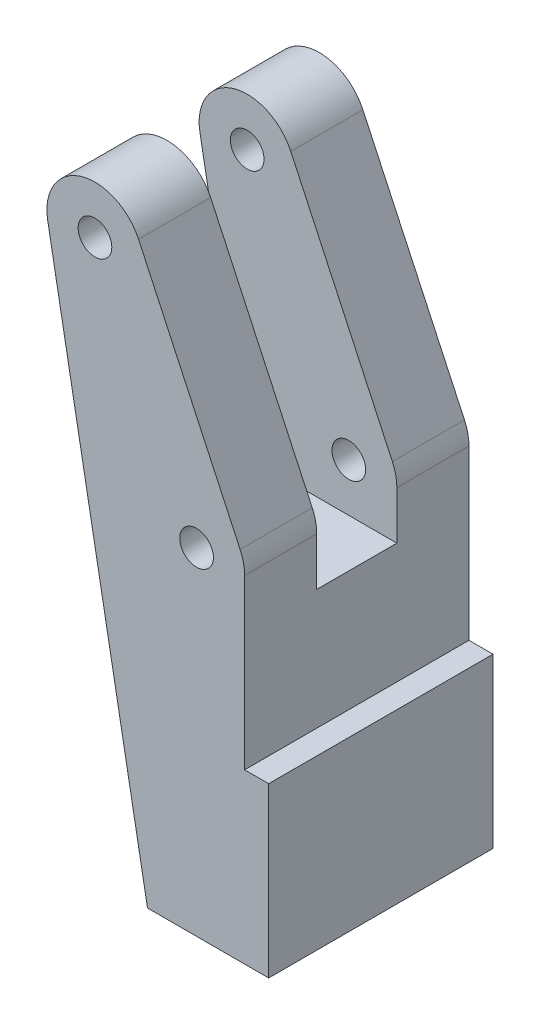
ISO-10303-21;
HEADER;
FILE_DESCRIPTION(('STEP AP214'),'2;1');
FILE_NAME('part.step','',(''),(''),'','','');
FILE_SCHEMA(('AUTOMOTIVE_DESIGN { 1 0 10303 214 1 1 1 1 }'));
ENDSEC;
DATA;
#1=APPLICATION_CONTEXT('core data for automotive mechanical design processes');
#2=APPLICATION_PROTOCOL_DEFINITION('international standard','automotive_design',2000,#1);
#3=PRODUCT_CONTEXT('',#1,'mechanical');
#4=PRODUCT('Part','Part','',(#3));
#5=PRODUCT_RELATED_PRODUCT_CATEGORY('part','',(#4));
#6=PRODUCT_DEFINITION_FORMATION('','',#4);
#7=PRODUCT_DEFINITION_CONTEXT('part definition',#1,'design');
#8=PRODUCT_DEFINITION('design','',#6,#7);
#9=PRODUCT_DEFINITION_SHAPE('','',#8);
#10=(LENGTH_UNIT() NAMED_UNIT(*) SI_UNIT(.MILLI.,.METRE.));
#11=(NAMED_UNIT(*) PLANE_ANGLE_UNIT() SI_UNIT($,.RADIAN.));
#12=(NAMED_UNIT(*) SI_UNIT($,.STERADIAN.) SOLID_ANGLE_UNIT());
#13=UNCERTAINTY_MEASURE_WITH_UNIT(LENGTH_MEASURE(1.E-05),#10,'distance_accuracy_value','');
#14=(GEOMETRIC_REPRESENTATION_CONTEXT(3) GLOBAL_UNCERTAINTY_ASSIGNED_CONTEXT((#13)) GLOBAL_UNIT_ASSIGNED_CONTEXT((#10,
#11,#12)) REPRESENTATION_CONTEXT('',''));
#15=CARTESIAN_POINT('',(0.,0.,0.));
#16=DIRECTION('',(0.,0.,1.));
#17=DIRECTION('',(1.,0.,0.));
#18=AXIS2_PLACEMENT_3D('',#15,#16,#17);
#19=CARTESIAN_POINT('',(5.,0.,7.5));
#20=DIRECTION('',(-1.,0.,0.));
#21=DIRECTION('',(0.,-1.,0.));
#22=AXIS2_PLACEMENT_3D('',#19,#20,#21);
#23=PLANE('',#22);
#24=DIRECTION('',(0.,0.,1.));
#25=VECTOR('',#24,1.);
#26=CARTESIAN_POINT('',(5.,-17.5,23.3333333333333));
#27=LINE('',#26,#25);
#28=CARTESIAN_POINT('',(5.,-17.5,0.));
#29=VERTEX_POINT('',#28);
#30=CARTESIAN_POINT('',(5.,-17.5,23.3333333333333));
#31=VERTEX_POINT('',#30);
#32=EDGE_CURVE('E160',#29,#31,#27,.T.);
#33=ORIENTED_EDGE('',*,*,#32,.F.);
#34=DIRECTION('',(0.,1.,0.));
#35=VECTOR('',#34,1.);
#36=CARTESIAN_POINT('',(5.,0.,0.));
#37=LINE('',#36,#35);
#38=CARTESIAN_POINT('',(5.,0.,0.));
#39=VERTEX_POINT('',#38);
#40=EDGE_CURVE('E166',#29,#39,#37,.T.);
#41=ORIENTED_EDGE('',*,*,#40,.T.);
#42=DIRECTION('',(0.,0.,-1.));
#43=VECTOR('',#42,1.);
#44=CARTESIAN_POINT('',(5.,0.,7.5));
#45=LINE('',#44,#43);
#46=CARTESIAN_POINT('',(5.,0.,7.5));
#47=VERTEX_POINT('',#46);
#48=EDGE_CURVE('E11',#47,#39,#45,.T.);
#49=ORIENTED_EDGE('',*,*,#48,.F.);
#50=DIRECTION('',(0.,1.,0.));
#51=VECTOR('',#50,1.);
#52=CARTESIAN_POINT('',(5.,0.,7.5));
#53=LINE('',#52,#51);
#54=CARTESIAN_POINT('',(5.,-5.,7.5));
#55=VERTEX_POINT('',#54);
#56=EDGE_CURVE('E273',#55,#47,#53,.T.);
#57=ORIENTED_EDGE('',*,*,#56,.F.);
#58=DIRECTION('',(0.,0.,-1.));
#59=VECTOR('',#58,1.);
#60=CARTESIAN_POINT('',(5.,-5.,15.8333333333333));
#61=LINE('',#60,#59);
#62=CARTESIAN_POINT('',(5.,-5.,15.8333333333333));
#63=VERTEX_POINT('',#62);
#64=EDGE_CURVE('E252',#63,#55,#61,.T.);
#65=ORIENTED_EDGE('',*,*,#64,.F.);
#66=DIRECTION('',(0.,1.,0.));
#67=VECTOR('',#66,1.);
#68=CARTESIAN_POINT('',(5.,0.,15.8333333333333));
#69=LINE('',#68,#67);
#70=CARTESIAN_POINT('',(5.,0.,15.8333333333333));
#71=VERTEX_POINT('',#70);
#72=EDGE_CURVE('E195',#63,#71,#69,.T.);
#73=ORIENTED_EDGE('',*,*,#72,.T.);
#74=DIRECTION('',(0.,0.,-1.));
#75=VECTOR('',#74,1.);
#76=CARTESIAN_POINT('',(5.,0.,23.3333333333333));
#77=LINE('',#76,#75);
#78=CARTESIAN_POINT('',(5.,0.,23.3333333333333));
#79=VERTEX_POINT('',#78);
#80=EDGE_CURVE('E211',#79,#71,#77,.T.);
#81=ORIENTED_EDGE('',*,*,#80,.F.);
#82=DIRECTION('',(0.,1.,0.));
#83=VECTOR('',#82,1.);
#84=CARTESIAN_POINT('',(5.,0.,23.3333333333333));
#85=LINE('',#84,#83);
#86=EDGE_CURVE('E208',#31,#79,#85,.T.);
#87=ORIENTED_EDGE('',*,*,#86,.F.);
#88=EDGE_LOOP('',(#33,#41,#49,#57,#65,#73,#81,#87));
#89=FACE_BOUND('',#88,.T.);
#90=ADVANCED_FACE('F39',(#89),#23,.F.);
#91=CARTESIAN_POINT('',(-10.5654565435173,22.6576946759163,7.5));
#92=DIRECTION('',(0.,0.,1.));
#93=DIRECTION('',(1.,0.,0.));
#94=AXIS2_PLACEMENT_3D('',#91,#92,#93);
#95=PLANE('',#94);
#96=DIRECTION('',(-1.,0.,0.));
#97=VECTOR('',#96,1.);
#98=CARTESIAN_POINT('',(5.,-5.,7.5));
#99=LINE('',#98,#97);
#100=CARTESIAN_POINT('',(-10.5898274549361,-5.,7.5));
#101=VERTEX_POINT('',#100);
#102=EDGE_CURVE('E63',#55,#101,#99,.T.);
#103=ORIENTED_EDGE('',*,*,#102,.F.);
#104=ORIENTED_EDGE('',*,*,#56,.T.);
#105=CARTESIAN_POINT('',(0.,0.,7.5));
#106=DIRECTION('',(0.,0.,1.));
#107=DIRECTION('',(1.,0.,0.));
#108=AXIS2_PLACEMENT_3D('',#105,#106,#107);
#109=CIRCLE('',#108,5.);
#110=CARTESIAN_POINT('',(4.53153893518326,2.11309130870347,7.5));
#111=VERTEX_POINT('',#110);
#112=EDGE_CURVE('E276',#47,#111,#109,.T.);
#113=ORIENTED_EDGE('',*,*,#112,.T.);
#114=DIRECTION('',(-0.422618261740694,0.906307787036653,0.));
#115=VECTOR('',#114,1.);
#116=CARTESIAN_POINT('',(-6.03391760833409,24.7707859846198,7.5));
#117=LINE('',#116,#115);
#118=CARTESIAN_POINT('',(-6.03391760833409,24.7707859846198,7.5));
#119=VERTEX_POINT('',#118);
#120=EDGE_CURVE('E280',#111,#119,#117,.T.);
#121=ORIENTED_EDGE('',*,*,#120,.T.);
#122=CARTESIAN_POINT('',(-10.5654565435173,22.6576946759163,7.5));
#123=DIRECTION('',(0.,0.,1.));
#124=DIRECTION('',(1.,0.,0.));
#125=AXIS2_PLACEMENT_3D('',#122,#123,#124);
#126=CIRCLE('',#125,5.);
#127=CARTESIAN_POINT('',(-15.48386758941,21.7581210082041,7.5));
#128=VERTEX_POINT('',#127);
#129=EDGE_CURVE('E283',#119,#128,#126,.T.);
#130=ORIENTED_EDGE('',*,*,#129,.T.);
#131=DIRECTION('',(0.17991473354245,-0.983682209178528,0.));
#132=VECTOR('',#131,1.);
#133=CARTESIAN_POINT('',(-5.10285009994166,-35.,7.5));
#134=LINE('',#133,#132);
#135=EDGE_CURVE('E286',#128,#101,#134,.T.);
#136=ORIENTED_EDGE('',*,*,#135,.T.);
#137=EDGE_LOOP('',(#103,#104,#113,#121,#130,#136));
#138=FACE_BOUND('',#137,.T.);
#139=CARTESIAN_POINT('',(-10.5654565435173,22.6576946759163,7.5));
#140=DIRECTION('',(0.,0.,1.));
#141=DIRECTION('',(1.,0.,0.));
#142=AXIS2_PLACEMENT_3D('',#139,#140,#141);
#143=CIRCLE('',#142,1.75);
#144=CARTESIAN_POINT('',(-8.81545654351735,22.6576946759163,7.5));
#145=VERTEX_POINT('',#144);
#146=EDGE_CURVE('E265',#145,#145,#143,.T.);
#147=ORIENTED_EDGE('',*,*,#146,.F.);
#148=EDGE_LOOP('',(#147));
#149=FACE_BOUND('',#148,.T.);
#150=CARTESIAN_POINT('',(0.,0.,7.5));
#151=DIRECTION('',(0.,0.,1.));
#152=DIRECTION('',(1.,0.,0.));
#153=AXIS2_PLACEMENT_3D('',#150,#151,#152);
#154=CIRCLE('',#153,1.75);
#155=CARTESIAN_POINT('',(1.75,0.,7.5));
#156=VERTEX_POINT('',#155);
#157=EDGE_CURVE('E257',#156,#156,#154,.T.);
#158=ORIENTED_EDGE('',*,*,#157,.F.);
#159=EDGE_LOOP('',(#158));
#160=FACE_BOUND('',#159,.T.);
#161=ADVANCED_FACE('F334',(#138,#149,#160),#95,.T.);
#162=CARTESIAN_POINT('',(-10.5654565435173,22.6576946759163,0.));
#163=DIRECTION('',(0.,0.,1.));
#164=DIRECTION('',(1.,0.,0.));
#165=AXIS2_PLACEMENT_3D('',#162,#163,#164);
#166=PLANE('',#165);
#167=DIRECTION('',(1.,0.,0.));
#168=VECTOR('',#167,1.);
#169=CARTESIAN_POINT('',(5.,-35.,0.));
#170=LINE('',#169,#168);
#171=CARTESIAN_POINT('',(-5.10285009994166,-35.,0.));
#172=VERTEX_POINT('',#171);
#173=CARTESIAN_POINT('',(7.50000000000001,-35.,0.));
#174=VERTEX_POINT('',#173);
#175=EDGE_CURVE('E269',#172,#174,#170,.T.);
#176=ORIENTED_EDGE('',*,*,#175,.F.);
#177=DIRECTION('',(0.17991473354245,-0.983682209178528,0.));
#178=VECTOR('',#177,1.);
#179=CARTESIAN_POINT('',(-5.10285009994166,-35.,0.));
#180=LINE('',#179,#178);
#181=CARTESIAN_POINT('',(-15.48386758941,21.7581210082041,0.));
#182=VERTEX_POINT('',#181);
#183=EDGE_CURVE('E277',#182,#172,#180,.T.);
#184=ORIENTED_EDGE('',*,*,#183,.F.);
#185=CARTESIAN_POINT('',(-10.5654565435173,22.6576946759163,0.));
#186=DIRECTION('',(0.,0.,1.));
#187=DIRECTION('',(1.,0.,0.));
#188=AXIS2_PLACEMENT_3D('',#185,#186,#187);
#189=CIRCLE('',#188,5.);
#190=CARTESIAN_POINT('',(-6.03391760833409,24.7707859846198,0.));
#191=VERTEX_POINT('',#190);
#192=EDGE_CURVE('E300',#191,#182,#189,.T.);
#193=ORIENTED_EDGE('',*,*,#192,.F.);
#194=DIRECTION('',(-0.422618261740694,0.906307787036653,0.));
#195=VECTOR('',#194,1.);
#196=CARTESIAN_POINT('',(-6.03391760833409,24.7707859846198,0.));
#197=LINE('',#196,#195);
#198=CARTESIAN_POINT('',(4.53153893518326,2.11309130870347,0.));
#199=VERTEX_POINT('',#198);
#200=EDGE_CURVE('E297',#199,#191,#197,.T.);
#201=ORIENTED_EDGE('',*,*,#200,.F.);
#202=CARTESIAN_POINT('',(0.,0.,0.));
#203=DIRECTION('',(0.,0.,1.));
#204=DIRECTION('',(1.,0.,0.));
#205=AXIS2_PLACEMENT_3D('',#202,#203,#204);
#206=CIRCLE('',#205,5.);
#207=EDGE_CURVE('E294',#39,#199,#206,.T.);
#208=ORIENTED_EDGE('',*,*,#207,.F.);
#209=ORIENTED_EDGE('',*,*,#40,.F.);
#210=DIRECTION('',(-1.,0.,0.));
#211=VECTOR('',#210,1.);
#212=CARTESIAN_POINT('',(7.5,-17.5,0.));
#213=LINE('',#212,#211);
#214=CARTESIAN_POINT('',(7.5,-17.5,0.));
#215=VERTEX_POINT('',#214);
#216=EDGE_CURVE('E144',#215,#29,#213,.T.);
#217=ORIENTED_EDGE('',*,*,#216,.F.);
#218=DIRECTION('',(0.,1.,0.));
#219=VECTOR('',#218,1.);
#220=CARTESIAN_POINT('',(7.5,-17.5,0.));
#221=LINE('',#220,#219);
#222=EDGE_CURVE('E150',#174,#215,#221,.T.);
#223=ORIENTED_EDGE('',*,*,#222,.F.);
#224=EDGE_LOOP('',(#176,#184,#193,#201,#208,#209,#217,#223));
#225=FACE_BOUND('',#224,.T.);
#226=CARTESIAN_POINT('',(-10.5654565435173,22.6576946759163,0.));
#227=DIRECTION('',(0.,0.,1.));
#228=DIRECTION('',(1.,0.,0.));
#229=AXIS2_PLACEMENT_3D('',#226,#227,#228);
#230=CIRCLE('',#229,1.75);
#231=CARTESIAN_POINT('',(-8.81545654351735,22.6576946759163,0.));
#232=VERTEX_POINT('',#231);
#233=EDGE_CURVE('E261',#232,#232,#230,.T.);
#234=ORIENTED_EDGE('',*,*,#233,.T.);
#235=EDGE_LOOP('',(#234));
#236=FACE_BOUND('',#235,.T.);
#237=CARTESIAN_POINT('',(0.,0.,0.));
#238=DIRECTION('',(0.,0.,1.));
#239=DIRECTION('',(1.,0.,0.));
#240=AXIS2_PLACEMENT_3D('',#237,#238,#239);
#241=CIRCLE('',#240,1.75);
#242=CARTESIAN_POINT('',(1.75,0.,0.));
#243=VERTEX_POINT('',#242);
#244=EDGE_CURVE('E256',#243,#243,#241,.T.);
#245=ORIENTED_EDGE('',*,*,#244,.T.);
#246=EDGE_LOOP('',(#245));
#247=FACE_BOUND('',#246,.T.);
#248=ADVANCED_FACE('F163',(#225,#236,#247),#166,.F.);
#249=CARTESIAN_POINT('',(5.,-35.,7.5));
#250=DIRECTION('',(0.,1.,0.));
#251=DIRECTION('',(0.,0.,1.));
#252=AXIS2_PLACEMENT_3D('',#249,#250,#251);
#253=PLANE('',#252);
#254=ORIENTED_EDGE('',*,*,#175,.T.);
#255=DIRECTION('',(0.,0.,-1.));
#256=VECTOR('',#255,1.);
#257=CARTESIAN_POINT('',(7.50000000000001,-35.,0.));
#258=LINE('',#257,#256);
#259=CARTESIAN_POINT('',(7.50000000000001,-35.,23.3333333333333));
#260=VERTEX_POINT('',#259);
#261=EDGE_CURVE('E156',#260,#174,#258,.T.);
#262=ORIENTED_EDGE('',*,*,#261,.F.);
#263=DIRECTION('',(1.,0.,0.));
#264=VECTOR('',#263,1.);
#265=CARTESIAN_POINT('',(5.,-35.,23.3333333333333));
#266=LINE('',#265,#264);
#267=CARTESIAN_POINT('',(-5.10285009994166,-35.,23.3333333333333));
#268=VERTEX_POINT('',#267);
#269=EDGE_CURVE('E205',#268,#260,#266,.T.);
#270=ORIENTED_EDGE('',*,*,#269,.F.);
#271=DIRECTION('',(0.,0.,-1.));
#272=VECTOR('',#271,1.);
#273=CARTESIAN_POINT('',(-5.10285009994166,-35.,7.5));
#274=LINE('',#273,#272);
#275=EDGE_CURVE('E289',#268,#172,#274,.T.);
#276=ORIENTED_EDGE('',*,*,#275,.T.);
#277=EDGE_LOOP('',(#254,#262,#270,#276));
#278=FACE_BOUND('',#277,.T.);
#279=ADVANCED_FACE('F41',(#278),#253,.F.);
#280=CARTESIAN_POINT('',(0.,0.,7.5));
#281=DIRECTION('',(0.,0.,-1.));
#282=DIRECTION('',(-1.,0.,0.));
#283=AXIS2_PLACEMENT_3D('',#280,#281,#282);
#284=CYLINDRICAL_SURFACE('',#283,5.);
#285=ORIENTED_EDGE('',*,*,#207,.T.);
#286=DIRECTION('',(0.,0.,-1.));
#287=VECTOR('',#286,1.);
#288=CARTESIAN_POINT('',(4.53153893518326,2.11309130870347,7.5));
#289=LINE('',#288,#287);
#290=EDGE_CURVE('E48',#111,#199,#289,.T.);
#291=ORIENTED_EDGE('',*,*,#290,.F.);
#292=ORIENTED_EDGE('',*,*,#112,.F.);
#293=ORIENTED_EDGE('',*,*,#48,.T.);
#294=EDGE_LOOP('',(#285,#291,#292,#293));
#295=FACE_BOUND('',#294,.T.);
#296=ADVANCED_FACE('F371',(#295),#284,.T.);
#297=CARTESIAN_POINT('',(-6.03391760833409,24.7707859846198,7.5));
#298=DIRECTION('',(-0.906307787036652,-0.422618261740694,0.));
#299=DIRECTION('',(0.422618261740694,-0.906307787036652,0.));
#300=AXIS2_PLACEMENT_3D('',#297,#298,#299);
#301=PLANE('',#300);
#302=ORIENTED_EDGE('',*,*,#200,.T.);
#303=DIRECTION('',(0.,0.,-1.));
#304=VECTOR('',#303,1.);
#305=CARTESIAN_POINT('',(-6.03391760833409,24.7707859846198,7.5));
#306=LINE('',#305,#304);
#307=EDGE_CURVE('E312',#119,#191,#306,.T.);
#308=ORIENTED_EDGE('',*,*,#307,.F.);
#309=ORIENTED_EDGE('',*,*,#120,.F.);
#310=ORIENTED_EDGE('',*,*,#290,.T.);
#311=EDGE_LOOP('',(#302,#308,#309,#310));
#312=FACE_BOUND('',#311,.T.);
#313=ADVANCED_FACE('F321',(#312),#301,.F.);
#314=CARTESIAN_POINT('',(-10.5654565435173,22.6576946759163,7.5));
#315=DIRECTION('',(0.,0.,-1.));
#316=DIRECTION('',(-1.,0.,0.));
#317=AXIS2_PLACEMENT_3D('',#314,#315,#316);
#318=CYLINDRICAL_SURFACE('',#317,5.);
#319=ORIENTED_EDGE('',*,*,#192,.T.);
#320=DIRECTION('',(0.,0.,-1.));
#321=VECTOR('',#320,1.);
#322=CARTESIAN_POINT('',(-15.48386758941,21.7581210082041,7.5));
#323=LINE('',#322,#321);
#324=EDGE_CURVE('E308',#128,#182,#323,.T.);
#325=ORIENTED_EDGE('',*,*,#324,.F.);
#326=ORIENTED_EDGE('',*,*,#129,.F.);
#327=ORIENTED_EDGE('',*,*,#307,.T.);
#328=EDGE_LOOP('',(#319,#325,#326,#327));
#329=FACE_BOUND('',#328,.T.);
#330=ADVANCED_FACE('F329',(#329),#318,.T.);
#331=CARTESIAN_POINT('',(-5.10285009994166,-35.,7.5));
#332=DIRECTION('',(0.983682209178528,0.17991473354245,0.));
#333=DIRECTION('',(-0.17991473354245,0.983682209178528,0.));
#334=AXIS2_PLACEMENT_3D('',#331,#332,#333);
#335=PLANE('',#334);
#336=ORIENTED_EDGE('',*,*,#183,.T.);
#337=ORIENTED_EDGE('',*,*,#275,.F.);
#338=DIRECTION('',(0.17991473354245,-0.983682209178528,0.));
#339=VECTOR('',#338,1.);
#340=CARTESIAN_POINT('',(-5.10285009994166,-35.,23.3333333333333));
#341=LINE('',#340,#339);
#342=CARTESIAN_POINT('',(-15.48386758941,21.7581210082041,23.3333333333333));
#343=VERTEX_POINT('',#342);
#344=EDGE_CURVE('E201',#343,#268,#341,.T.);
#345=ORIENTED_EDGE('',*,*,#344,.F.);
#346=DIRECTION('',(0.,0.,-1.));
#347=VECTOR('',#346,1.);
#348=CARTESIAN_POINT('',(-15.48386758941,21.7581210082041,23.3333333333333));
#349=LINE('',#348,#347);
#350=CARTESIAN_POINT('',(-15.48386758941,21.7581210082041,15.8333333333333));
#351=VERTEX_POINT('',#350);
#352=EDGE_CURVE('E230',#343,#351,#349,.T.);
#353=ORIENTED_EDGE('',*,*,#352,.T.);
#354=DIRECTION('',(0.17991473354245,-0.983682209178528,0.));
#355=VECTOR('',#354,1.);
#356=CARTESIAN_POINT('',(-5.10285009994166,-35.,15.8333333333333));
#357=LINE('',#356,#355);
#358=CARTESIAN_POINT('',(-10.5898274549361,-5.,15.8333333333333));
#359=VERTEX_POINT('',#358);
#360=EDGE_CURVE('E221',#351,#359,#357,.T.);
#361=ORIENTED_EDGE('',*,*,#360,.T.);
#362=DIRECTION('',(0.,0.,-1.));
#363=VECTOR('',#362,1.);
#364=CARTESIAN_POINT('',(-10.5898274549361,-5.,15.8333333333333));
#365=LINE('',#364,#363);
#366=EDGE_CURVE('E246',#359,#101,#365,.T.);
#367=ORIENTED_EDGE('',*,*,#366,.T.);
#368=ORIENTED_EDGE('',*,*,#135,.F.);
#369=ORIENTED_EDGE('',*,*,#324,.T.);
#370=EDGE_LOOP('',(#336,#337,#345,#353,#361,#367,#368,#369));
#371=FACE_BOUND('',#370,.T.);
#372=ADVANCED_FACE('F333',(#371),#335,.F.);
#373=CARTESIAN_POINT('',(-10.5654565435173,22.6576946759163,7.5));
#374=DIRECTION('',(0.,0.,-1.));
#375=DIRECTION('',(-1.,0.,0.));
#376=AXIS2_PLACEMENT_3D('',#373,#374,#375);
#377=CYLINDRICAL_SURFACE('',#376,1.75);
#378=ORIENTED_EDGE('',*,*,#146,.T.);
#379=EDGE_LOOP('',(#378));
#380=FACE_BOUND('',#379,.T.);
#381=ORIENTED_EDGE('',*,*,#233,.F.);
#382=EDGE_LOOP('',(#381));
#383=FACE_BOUND('',#382,.T.);
#384=ADVANCED_FACE('F392',(#380,#383),#377,.F.);
#385=CARTESIAN_POINT('',(0.,0.,7.5));
#386=DIRECTION('',(0.,0.,-1.));
#387=DIRECTION('',(-1.,0.,0.));
#388=AXIS2_PLACEMENT_3D('',#385,#386,#387);
#389=CYLINDRICAL_SURFACE('',#388,1.75);
#390=ORIENTED_EDGE('',*,*,#157,.T.);
#391=EDGE_LOOP('',(#390));
#392=FACE_BOUND('',#391,.T.);
#393=ORIENTED_EDGE('',*,*,#244,.F.);
#394=EDGE_LOOP('',(#393));
#395=FACE_BOUND('',#394,.T.);
#396=ADVANCED_FACE('F396',(#392,#395),#389,.F.);
#397=CARTESIAN_POINT('',(5.,-5.,15.8333333333333));
#398=DIRECTION('',(0.,-1.,0.));
#399=DIRECTION('',(1.,0.,0.));
#400=AXIS2_PLACEMENT_3D('',#397,#398,#399);
#401=PLANE('',#400);
#402=ORIENTED_EDGE('',*,*,#102,.T.);
#403=ORIENTED_EDGE('',*,*,#366,.F.);
#404=DIRECTION('',(-1.,0.,0.));
#405=VECTOR('',#404,1.);
#406=CARTESIAN_POINT('',(5.,-5.,15.8333333333333));
#407=LINE('',#406,#405);
#408=EDGE_CURVE('E242',#63,#359,#407,.T.);
#409=ORIENTED_EDGE('',*,*,#408,.F.);
#410=ORIENTED_EDGE('',*,*,#64,.T.);
#411=EDGE_LOOP('',(#402,#403,#409,#410));
#412=FACE_BOUND('',#411,.T.);
#413=ADVANCED_FACE('F337',(#412),#401,.F.);
#414=CARTESIAN_POINT('',(0.,0.,15.8333333333333));
#415=DIRECTION('',(0.,0.,1.));
#416=DIRECTION('',(1.,0.,0.));
#417=AXIS2_PLACEMENT_3D('',#414,#415,#416);
#418=PLANE('',#417);
#419=CARTESIAN_POINT('',(0.,0.,15.8333333333333));
#420=DIRECTION('',(0.,0.,1.));
#421=DIRECTION('',(1.,0.,0.));
#422=AXIS2_PLACEMENT_3D('',#419,#420,#421);
#423=CIRCLE('',#422,1.74999999999993);
#424=CARTESIAN_POINT('',(1.74999999999985,0.,15.8333333333333));
#425=VERTEX_POINT('',#424);
#426=EDGE_CURVE('E180',#425,#425,#423,.T.);
#427=ORIENTED_EDGE('',*,*,#426,.T.);
#428=EDGE_LOOP('',(#427));
#429=FACE_BOUND('',#428,.T.);
#430=CARTESIAN_POINT('',(-10.5654565435173,22.6576946759163,15.8333333333333));
#431=DIRECTION('',(0.,0.,1.));
#432=DIRECTION('',(1.,0.,0.));
#433=AXIS2_PLACEMENT_3D('',#430,#431,#432);
#434=CIRCLE('',#433,1.75);
#435=CARTESIAN_POINT('',(-8.81545654351735,22.6576946759163,15.8333333333333));
#436=VERTEX_POINT('',#435);
#437=EDGE_CURVE('E168',#436,#436,#434,.T.);
#438=ORIENTED_EDGE('',*,*,#437,.T.);
#439=EDGE_LOOP('',(#438));
#440=FACE_BOUND('',#439,.T.);
#441=ORIENTED_EDGE('',*,*,#72,.F.);
#442=ORIENTED_EDGE('',*,*,#408,.T.);
#443=ORIENTED_EDGE('',*,*,#360,.F.);
#444=CARTESIAN_POINT('',(-10.5654565435173,22.6576946759163,15.8333333333333));
#445=DIRECTION('',(0.,0.,1.));
#446=DIRECTION('',(-1.,0.,0.));
#447=AXIS2_PLACEMENT_3D('',#444,#445,#446);
#448=CIRCLE('',#447,5.);
#449=CARTESIAN_POINT('',(-6.03391760833409,24.7707859846198,15.8333333333333));
#450=VERTEX_POINT('',#449);
#451=EDGE_CURVE('E218',#450,#351,#448,.T.);
#452=ORIENTED_EDGE('',*,*,#451,.F.);
#453=DIRECTION('',(-0.422618261740694,0.906307787036653,0.));
#454=VECTOR('',#453,1.);
#455=CARTESIAN_POINT('',(-6.03391760833409,24.7707859846198,15.8333333333333));
#456=LINE('',#455,#454);
#457=CARTESIAN_POINT('',(4.53153893518326,2.11309130870347,15.8333333333333));
#458=VERTEX_POINT('',#457);
#459=EDGE_CURVE('E215',#458,#450,#456,.T.);
#460=ORIENTED_EDGE('',*,*,#459,.F.);
#461=CARTESIAN_POINT('',(0.,0.,15.8333333333333));
#462=DIRECTION('',(0.,0.,1.));
#463=DIRECTION('',(1.,0.,0.));
#464=AXIS2_PLACEMENT_3D('',#461,#462,#463);
#465=CIRCLE('',#464,5.00000000000008);
#466=EDGE_CURVE('E186',#71,#458,#465,.T.);
#467=ORIENTED_EDGE('',*,*,#466,.F.);
#468=EDGE_LOOP('',(#441,#442,#443,#452,#460,#467));
#469=FACE_BOUND('',#468,.T.);
#470=ADVANCED_FACE('F345',(#429,#440,#469),#418,.F.);
#471=CARTESIAN_POINT('',(0.,0.,23.3333333333333));
#472=DIRECTION('',(0.,0.,1.));
#473=DIRECTION('',(1.,0.,0.));
#474=AXIS2_PLACEMENT_3D('',#471,#472,#473);
#475=PLANE('',#474);
#476=CARTESIAN_POINT('',(0.,0.,23.3333333333333));
#477=DIRECTION('',(0.,0.,1.));
#478=DIRECTION('',(1.,0.,0.));
#479=AXIS2_PLACEMENT_3D('',#476,#477,#478);
#480=CIRCLE('',#479,1.74999999999993);
#481=CARTESIAN_POINT('',(1.74999999999985,0.,23.3333333333333));
#482=VERTEX_POINT('',#481);
#483=EDGE_CURVE('E182',#482,#482,#480,.T.);
#484=ORIENTED_EDGE('',*,*,#483,.F.);
#485=EDGE_LOOP('',(#484));
#486=FACE_BOUND('',#485,.T.);
#487=CARTESIAN_POINT('',(0.,0.,23.3333333333333));
#488=DIRECTION('',(0.,0.,1.));
#489=DIRECTION('',(1.,0.,0.));
#490=AXIS2_PLACEMENT_3D('',#487,#488,#489);
#491=CIRCLE('',#490,5.00000000000008);
#492=CARTESIAN_POINT('',(4.53153893518326,2.11309130870347,23.3333333333333));
#493=VERTEX_POINT('',#492);
#494=EDGE_CURVE('E190',#79,#493,#491,.T.);
#495=ORIENTED_EDGE('',*,*,#494,.T.);
#496=DIRECTION('',(-0.422618261740694,0.906307787036653,0.));
#497=VECTOR('',#496,1.);
#498=CARTESIAN_POINT('',(-6.03391760833409,24.7707859846198,23.3333333333333));
#499=LINE('',#498,#497);
#500=CARTESIAN_POINT('',(-6.03391760833409,24.7707859846198,23.3333333333333));
#501=VERTEX_POINT('',#500);
#502=EDGE_CURVE('E194',#493,#501,#499,.T.);
#503=ORIENTED_EDGE('',*,*,#502,.T.);
#504=CARTESIAN_POINT('',(-10.5654565435173,22.6576946759163,23.3333333333333));
#505=DIRECTION('',(0.,0.,1.));
#506=DIRECTION('',(-1.,0.,0.));
#507=AXIS2_PLACEMENT_3D('',#504,#505,#506);
#508=CIRCLE('',#507,5.);
#509=EDGE_CURVE('E198',#501,#343,#508,.T.);
#510=ORIENTED_EDGE('',*,*,#509,.T.);
#511=ORIENTED_EDGE('',*,*,#344,.T.);
#512=ORIENTED_EDGE('',*,*,#269,.T.);
#513=DIRECTION('',(0.,-1.,0.));
#514=VECTOR('',#513,1.);
#515=CARTESIAN_POINT('',(7.50000000000001,-35.,23.3333333333333));
#516=LINE('',#515,#514);
#517=CARTESIAN_POINT('',(7.5,-17.5,23.3333333333333));
#518=VERTEX_POINT('',#517);
#519=EDGE_CURVE('E149',#518,#260,#516,.T.);
#520=ORIENTED_EDGE('',*,*,#519,.F.);
#521=DIRECTION('',(-1.,0.,0.));
#522=VECTOR('',#521,1.);
#523=CARTESIAN_POINT('',(7.5,-17.5,23.3333333333333));
#524=LINE('',#523,#522);
#525=EDGE_CURVE('E55',#518,#31,#524,.T.);
#526=ORIENTED_EDGE('',*,*,#525,.T.);
#527=ORIENTED_EDGE('',*,*,#86,.T.);
#528=EDGE_LOOP('',(#495,#503,#510,#511,#512,#520,#526,#527));
#529=FACE_BOUND('',#528,.T.);
#530=CARTESIAN_POINT('',(-10.5654565435173,22.6576946759163,23.3333333333333));
#531=DIRECTION('',(0.,0.,1.));
#532=DIRECTION('',(1.,0.,0.));
#533=AXIS2_PLACEMENT_3D('',#530,#531,#532);
#534=CIRCLE('',#533,1.75);
#535=CARTESIAN_POINT('',(-8.81545654351735,22.6576946759163,23.3333333333333));
#536=VERTEX_POINT('',#535);
#537=EDGE_CURVE('E173',#536,#536,#534,.T.);
#538=ORIENTED_EDGE('',*,*,#537,.F.);
#539=EDGE_LOOP('',(#538));
#540=FACE_BOUND('',#539,.T.);
#541=ADVANCED_FACE('F353',(#486,#529,#540),#475,.T.);
#542=CARTESIAN_POINT('',(0.,0.,23.3333333333333));
#543=DIRECTION('',(0.,0.,-1.));
#544=DIRECTION('',(-1.,0.,0.));
#545=AXIS2_PLACEMENT_3D('',#542,#543,#544);
#546=CYLINDRICAL_SURFACE('',#545,5.00000000000008);
#547=ORIENTED_EDGE('',*,*,#466,.T.);
#548=DIRECTION('',(0.,0.,-1.));
#549=VECTOR('',#548,1.);
#550=CARTESIAN_POINT('',(4.53153893518326,2.11309130870347,23.3333333333333));
#551=LINE('',#550,#549);
#552=EDGE_CURVE('E238',#493,#458,#551,.T.);
#553=ORIENTED_EDGE('',*,*,#552,.F.);
#554=ORIENTED_EDGE('',*,*,#494,.F.);
#555=ORIENTED_EDGE('',*,*,#80,.T.);
#556=EDGE_LOOP('',(#547,#553,#554,#555));
#557=FACE_BOUND('',#556,.T.);
#558=ADVANCED_FACE('F350',(#557),#546,.T.);
#559=CARTESIAN_POINT('',(-6.03391760833409,24.7707859846198,23.3333333333333));
#560=DIRECTION('',(-0.906307787036652,-0.422618261740694,0.));
#561=DIRECTION('',(0.422618261740694,-0.906307787036652,0.));
#562=AXIS2_PLACEMENT_3D('',#559,#560,#561);
#563=PLANE('',#562);
#564=ORIENTED_EDGE('',*,*,#459,.T.);
#565=DIRECTION('',(0.,0.,-1.));
#566=VECTOR('',#565,1.);
#567=CARTESIAN_POINT('',(-6.03391760833409,24.7707859846198,23.3333333333333));
#568=LINE('',#567,#566);
#569=EDGE_CURVE('E234',#501,#450,#568,.T.);
#570=ORIENTED_EDGE('',*,*,#569,.F.);
#571=ORIENTED_EDGE('',*,*,#502,.F.);
#572=ORIENTED_EDGE('',*,*,#552,.T.);
#573=EDGE_LOOP('',(#564,#570,#571,#572));
#574=FACE_BOUND('',#573,.T.);
#575=ADVANCED_FACE('F359',(#574),#563,.F.);
#576=CARTESIAN_POINT('',(-10.5654565435173,22.6576946759163,23.3333333333333));
#577=DIRECTION('',(0.,0.,-1.));
#578=DIRECTION('',(-1.,0.,0.));
#579=AXIS2_PLACEMENT_3D('',#576,#577,#578);
#580=CYLINDRICAL_SURFACE('',#579,5.);
#581=ORIENTED_EDGE('',*,*,#451,.T.);
#582=ORIENTED_EDGE('',*,*,#352,.F.);
#583=ORIENTED_EDGE('',*,*,#509,.F.);
#584=ORIENTED_EDGE('',*,*,#569,.T.);
#585=EDGE_LOOP('',(#581,#582,#583,#584));
#586=FACE_BOUND('',#585,.T.);
#587=ADVANCED_FACE('F361',(#586),#580,.T.);
#588=CARTESIAN_POINT('',(0.,0.,23.3333333333333));
#589=DIRECTION('',(0.,0.,-1.));
#590=DIRECTION('',(-1.,0.,0.));
#591=AXIS2_PLACEMENT_3D('',#588,#589,#590);
#592=CYLINDRICAL_SURFACE('',#591,1.74999999999993);
#593=ORIENTED_EDGE('',*,*,#483,.T.);
#594=EDGE_LOOP('',(#593));
#595=FACE_BOUND('',#594,.T.);
#596=ORIENTED_EDGE('',*,*,#426,.F.);
#597=EDGE_LOOP('',(#596));
#598=FACE_BOUND('',#597,.T.);
#599=ADVANCED_FACE('F409',(#595,#598),#592,.F.);
#600=CARTESIAN_POINT('',(-10.5654565435173,22.6576946759163,23.3333333333333));
#601=DIRECTION('',(0.,0.,-1.));
#602=DIRECTION('',(-1.,0.,0.));
#603=AXIS2_PLACEMENT_3D('',#600,#601,#602);
#604=CYLINDRICAL_SURFACE('',#603,1.75);
#605=ORIENTED_EDGE('',*,*,#537,.T.);
#606=EDGE_LOOP('',(#605));
#607=FACE_BOUND('',#606,.T.);
#608=ORIENTED_EDGE('',*,*,#437,.F.);
#609=EDGE_LOOP('',(#608));
#610=FACE_BOUND('',#609,.T.);
#611=ADVANCED_FACE('F417',(#607,#610),#604,.F.);
#612=CARTESIAN_POINT('',(7.5,-17.5,23.3333333333333));
#613=DIRECTION('',(0.,-1.,0.));
#614=DIRECTION('',(1.,0.,0.));
#615=AXIS2_PLACEMENT_3D('',#612,#613,#614);
#616=PLANE('',#615);
#617=ORIENTED_EDGE('',*,*,#32,.T.);
#618=ORIENTED_EDGE('',*,*,#525,.F.);
#619=DIRECTION('',(0.,0.,1.));
#620=VECTOR('',#619,1.);
#621=CARTESIAN_POINT('',(7.5,-17.5,23.3333333333333));
#622=LINE('',#621,#620);
#623=EDGE_CURVE('E140',#215,#518,#622,.T.);
#624=ORIENTED_EDGE('',*,*,#623,.F.);
#625=ORIENTED_EDGE('',*,*,#216,.T.);
#626=EDGE_LOOP('',(#617,#618,#624,#625));
#627=FACE_BOUND('',#626,.T.);
#628=ADVANCED_FACE('F142',(#627),#616,.F.);
#629=CARTESIAN_POINT('',(7.5,0.,0.));
#630=DIRECTION('',(-1.,0.,0.));
#631=DIRECTION('',(0.,-1.,0.));
#632=AXIS2_PLACEMENT_3D('',#629,#630,#631);
#633=PLANE('',#632);
#634=ORIENTED_EDGE('',*,*,#222,.T.);
#635=ORIENTED_EDGE('',*,*,#623,.T.);
#636=ORIENTED_EDGE('',*,*,#519,.T.);
#637=ORIENTED_EDGE('',*,*,#261,.T.);
#638=EDGE_LOOP('',(#634,#635,#636,#637));
#639=FACE_BOUND('',#638,.T.);
#640=ADVANCED_FACE('F154',(#639),#633,.F.);
#641=CLOSED_SHELL('',(#90,#161,#248,#279,#296,#313,#330,#372,#384,#396,#413,#470,#541,#558,#575,
#587,#599,#611,#628,#640));
#642=MANIFOLD_SOLID_BREP('B2',#641);
#643=ADVANCED_BREP_SHAPE_REPRESENTATION('',(#18,#642),#14);
#644=SHAPE_DEFINITION_REPRESENTATION(#9,#643);
ENDSEC;
END-ISO-10303-21;
